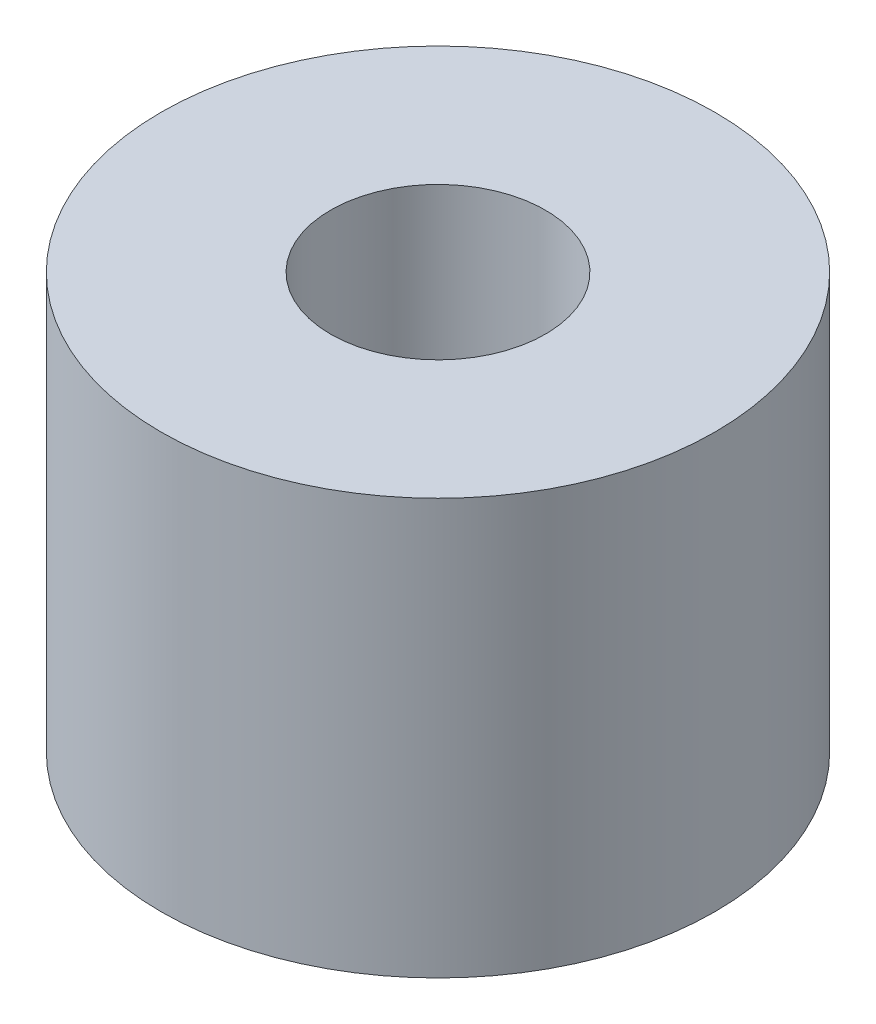
ISO-10303-21;
HEADER;
FILE_DESCRIPTION(('STEP AP214'),'2;1');
FILE_NAME('part.step','',(''),(''),'','','');
FILE_SCHEMA(('AUTOMOTIVE_DESIGN { 1 0 10303 214 1 1 1 1 }'));
ENDSEC;
DATA;
#1=APPLICATION_CONTEXT('core data for automotive mechanical design processes');
#2=APPLICATION_PROTOCOL_DEFINITION('international standard','automotive_design',2000,#1);
#3=PRODUCT_CONTEXT('',#1,'mechanical');
#4=PRODUCT('Part','Part','',(#3));
#5=PRODUCT_RELATED_PRODUCT_CATEGORY('part','',(#4));
#6=PRODUCT_DEFINITION_FORMATION('','',#4);
#7=PRODUCT_DEFINITION_CONTEXT('part definition',#1,'design');
#8=PRODUCT_DEFINITION('design','',#6,#7);
#9=PRODUCT_DEFINITION_SHAPE('','',#8);
#10=(LENGTH_UNIT() NAMED_UNIT(*) SI_UNIT(.MILLI.,.METRE.));
#11=(NAMED_UNIT(*) PLANE_ANGLE_UNIT() SI_UNIT($,.RADIAN.));
#12=(NAMED_UNIT(*) SI_UNIT($,.STERADIAN.) SOLID_ANGLE_UNIT());
#13=UNCERTAINTY_MEASURE_WITH_UNIT(LENGTH_MEASURE(1.E-05),#10,'distance_accuracy_value','');
#14=(GEOMETRIC_REPRESENTATION_CONTEXT(3) GLOBAL_UNCERTAINTY_ASSIGNED_CONTEXT((#13)) GLOBAL_UNIT_ASSIGNED_CONTEXT((#10,
#11,#12)) REPRESENTATION_CONTEXT('',''));
#15=CARTESIAN_POINT('',(0.,0.,0.));
#16=DIRECTION('',(0.,0.,1.));
#17=DIRECTION('',(1.,0.,0.));
#18=AXIS2_PLACEMENT_3D('',#15,#16,#17);
#19=CARTESIAN_POINT('',(0.,4.7625,0.));
#20=DIRECTION('',(0.,-1.,0.));
#21=DIRECTION('',(0.,0.,1.));
#22=AXIS2_PLACEMENT_3D('',#19,#20,#21);
#23=CYLINDRICAL_SURFACE('',#22,2.4638);
#24=CARTESIAN_POINT('',(0.,-4.7625,0.));
#25=DIRECTION('',(0.,1.,0.));
#26=DIRECTION('',(0.,0.,1.));
#27=AXIS2_PLACEMENT_3D('',#24,#25,#26);
#28=CIRCLE('',#27,2.4638);
#29=CARTESIAN_POINT('',(0.,-4.7625,2.4638));
#30=VERTEX_POINT('',#29);
#31=EDGE_CURVE('E44',#30,#30,#28,.T.);
#32=ORIENTED_EDGE('',*,*,#31,.F.);
#33=EDGE_LOOP('',(#32));
#34=FACE_BOUND('',#33,.T.);
#35=CARTESIAN_POINT('',(0.,4.7625,0.));
#36=DIRECTION('',(0.,1.,0.));
#37=DIRECTION('',(0.,0.,1.));
#38=AXIS2_PLACEMENT_3D('',#35,#36,#37);
#39=CIRCLE('',#38,2.4638);
#40=CARTESIAN_POINT('',(0.,4.7625,2.4638));
#41=VERTEX_POINT('',#40);
#42=EDGE_CURVE('E35',#41,#41,#39,.T.);
#43=ORIENTED_EDGE('',*,*,#42,.T.);
#44=EDGE_LOOP('',(#43));
#45=FACE_BOUND('',#44,.T.);
#46=ADVANCED_FACE('F32',(#34,#45),#23,.F.);
#47=CARTESIAN_POINT('',(0.,4.7625,0.));
#48=DIRECTION('',(0.,1.,0.));
#49=DIRECTION('',(0.,0.,-1.));
#50=AXIS2_PLACEMENT_3D('',#47,#48,#49);
#51=PLANE('',#50);
#52=ORIENTED_EDGE('',*,*,#42,.F.);
#53=EDGE_LOOP('',(#52));
#54=FACE_BOUND('',#53,.T.);
#55=CARTESIAN_POINT('',(0.,4.7625,0.));
#56=DIRECTION('',(0.,1.,0.));
#57=DIRECTION('',(0.,0.,1.));
#58=AXIS2_PLACEMENT_3D('',#55,#56,#57);
#59=CIRCLE('',#58,6.35);
#60=CARTESIAN_POINT('',(0.,4.7625,6.35));
#61=VERTEX_POINT('',#60);
#62=EDGE_CURVE('E39',#61,#61,#59,.T.);
#63=ORIENTED_EDGE('',*,*,#62,.T.);
#64=EDGE_LOOP('',(#63));
#65=FACE_BOUND('',#64,.T.);
#66=ADVANCED_FACE('F53',(#54,#65),#51,.T.);
#67=CARTESIAN_POINT('',(0.,-4.7625,0.));
#68=DIRECTION('',(0.,1.,0.));
#69=DIRECTION('',(0.,0.,-1.));
#70=AXIS2_PLACEMENT_3D('',#67,#68,#69);
#71=PLANE('',#70);
#72=ORIENTED_EDGE('',*,*,#31,.T.);
#73=EDGE_LOOP('',(#72));
#74=FACE_BOUND('',#73,.T.);
#75=CARTESIAN_POINT('',(0.,-4.7625,0.));
#76=DIRECTION('',(0.,1.,0.));
#77=DIRECTION('',(0.,0.,1.));
#78=AXIS2_PLACEMENT_3D('',#75,#76,#77);
#79=CIRCLE('',#78,6.35);
#80=CARTESIAN_POINT('',(0.,-4.7625,6.35));
#81=VERTEX_POINT('',#80);
#82=EDGE_CURVE('E10',#81,#81,#79,.F.);
#83=ORIENTED_EDGE('',*,*,#82,.T.);
#84=EDGE_LOOP('',(#83));
#85=FACE_BOUND('',#84,.T.);
#86=ADVANCED_FACE('F56',(#74,#85),#71,.F.);
#87=CARTESIAN_POINT('',(0.,4.7625,0.));
#88=DIRECTION('',(0.,-1.,0.));
#89=DIRECTION('',(0.,0.,1.));
#90=AXIS2_PLACEMENT_3D('',#87,#88,#89);
#91=CYLINDRICAL_SURFACE('',#90,6.35);
#92=ORIENTED_EDGE('',*,*,#82,.F.);
#93=EDGE_LOOP('',(#92));
#94=FACE_BOUND('',#93,.T.);
#95=ORIENTED_EDGE('',*,*,#62,.F.);
#96=EDGE_LOOP('',(#95));
#97=FACE_BOUND('',#96,.T.);
#98=ADVANCED_FACE('F59',(#94,#97),#91,.T.);
#99=CLOSED_SHELL('',(#46,#66,#86,#98));
#100=MANIFOLD_SOLID_BREP('B2',#99);
#101=ADVANCED_BREP_SHAPE_REPRESENTATION('',(#18,#100),#14);
#102=SHAPE_DEFINITION_REPRESENTATION(#9,#101);
ENDSEC;
END-ISO-10303-21;
